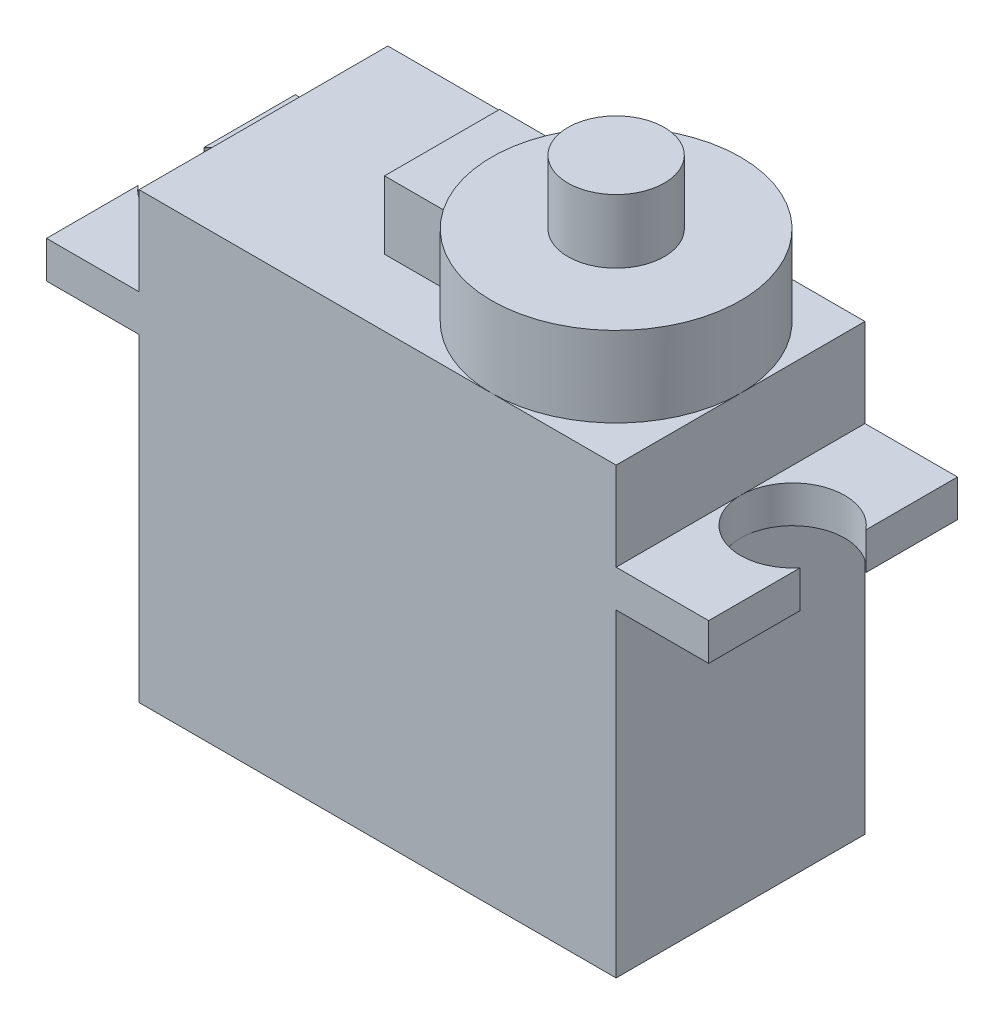
ISO-10303-21;
HEADER;
FILE_DESCRIPTION(('STEP AP214'),'2;1');
FILE_NAME('part.step','',(''),(''),'','','');
FILE_SCHEMA(('AUTOMOTIVE_DESIGN { 1 0 10303 214 1 1 1 1 }'));
ENDSEC;
DATA;
#1=APPLICATION_CONTEXT('core data for automotive mechanical design processes');
#2=APPLICATION_PROTOCOL_DEFINITION('international standard','automotive_design',2000,#1);
#3=PRODUCT_CONTEXT('',#1,'mechanical');
#4=PRODUCT('Part','Part','',(#3));
#5=PRODUCT_RELATED_PRODUCT_CATEGORY('part','',(#4));
#6=PRODUCT_DEFINITION_FORMATION('','',#4);
#7=PRODUCT_DEFINITION_CONTEXT('part definition',#1,'design');
#8=PRODUCT_DEFINITION('design','',#6,#7);
#9=PRODUCT_DEFINITION_SHAPE('','',#8);
#10=(LENGTH_UNIT() NAMED_UNIT(*) SI_UNIT(.MILLI.,.METRE.));
#11=(NAMED_UNIT(*) PLANE_ANGLE_UNIT() SI_UNIT($,.RADIAN.));
#12=(NAMED_UNIT(*) SI_UNIT($,.STERADIAN.) SOLID_ANGLE_UNIT());
#13=UNCERTAINTY_MEASURE_WITH_UNIT(LENGTH_MEASURE(1.E-05),#10,'distance_accuracy_value','');
#14=(GEOMETRIC_REPRESENTATION_CONTEXT(3) GLOBAL_UNCERTAINTY_ASSIGNED_CONTEXT((#13)) GLOBAL_UNIT_ASSIGNED_CONTEXT((#10,
#11,#12)) REPRESENTATION_CONTEXT('',''));
#15=CARTESIAN_POINT('',(0.,0.,0.));
#16=DIRECTION('',(0.,0.,1.));
#17=DIRECTION('',(1.,0.,0.));
#18=AXIS2_PLACEMENT_3D('',#15,#16,#17);
#19=CARTESIAN_POINT('',(0.,21.6,0.));
#20=DIRECTION('',(0.,1.,0.));
#21=DIRECTION('',(0.,0.,1.));
#22=AXIS2_PLACEMENT_3D('',#19,#20,#21);
#23=PLANE('',#22);
#24=DIRECTION('',(0.,0.,1.));
#25=VECTOR('',#24,1.);
#26=CARTESIAN_POINT('',(-2.91306815172061,21.6,-2.8));
#27=LINE('',#26,#25);
#28=CARTESIAN_POINT('',(-2.91306815172061,21.6,-2.8));
#29=VERTEX_POINT('',#28);
#30=CARTESIAN_POINT('',(-2.91306815172061,21.6,2.8));
#31=VERTEX_POINT('',#30);
#32=EDGE_CURVE('E243',#29,#31,#27,.T.);
#33=ORIENTED_EDGE('',*,*,#32,.F.);
#34=DIRECTION('',(-1.,0.,0.));
#35=VECTOR('',#34,1.);
#36=CARTESIAN_POINT('',(-2.91306815172061,21.6,-2.8));
#37=LINE('',#36,#35);
#38=CARTESIAN_POINT('',(0.186931848279386,21.6,-2.8));
#39=VERTEX_POINT('',#38);
#40=EDGE_CURVE('E231',#39,#29,#37,.T.);
#41=ORIENTED_EDGE('',*,*,#40,.F.);
#42=CARTESIAN_POINT('',(5.55,21.6,0.));
#43=DIRECTION('',(0.,1.,0.));
#44=DIRECTION('',(0.,0.,1.));
#45=AXIS2_PLACEMENT_3D('',#42,#43,#44);
#46=CIRCLE('',#45,6.05);
#47=CARTESIAN_POINT('',(5.55,21.6,-6.05));
#48=VERTEX_POINT('',#47);
#49=EDGE_CURVE('E83',#48,#39,#46,.T.);
#50=ORIENTED_EDGE('',*,*,#49,.F.);
#51=DIRECTION('',(-1.,0.,0.));
#52=VECTOR('',#51,1.);
#53=CARTESIAN_POINT('',(-11.6,21.6,-6.05));
#54=LINE('',#53,#52);
#55=CARTESIAN_POINT('',(-11.6,21.6,-6.05));
#56=VERTEX_POINT('',#55);
#57=EDGE_CURVE('E366',#48,#56,#54,.T.);
#58=ORIENTED_EDGE('',*,*,#57,.T.);
#59=DIRECTION('',(0.,0.,1.));
#60=VECTOR('',#59,1.);
#61=CARTESIAN_POINT('',(-11.6,21.6,-6.05));
#62=LINE('',#61,#60);
#63=CARTESIAN_POINT('',(-11.6,21.6,6.05));
#64=VERTEX_POINT('',#63);
#65=EDGE_CURVE('E371',#56,#64,#62,.T.);
#66=ORIENTED_EDGE('',*,*,#65,.T.);
#67=DIRECTION('',(1.,0.,0.));
#68=VECTOR('',#67,1.);
#69=CARTESIAN_POINT('',(-11.6,21.6,6.05));
#70=LINE('',#69,#68);
#71=CARTESIAN_POINT('',(5.55,21.6,6.05));
#72=VERTEX_POINT('',#71);
#73=EDGE_CURVE('E374',#64,#72,#70,.T.);
#74=ORIENTED_EDGE('',*,*,#73,.T.);
#75=CARTESIAN_POINT('',(0.186931848279386,21.6,2.8));
#76=VERTEX_POINT('',#75);
#77=EDGE_CURVE('E259',#76,#72,#46,.T.);
#78=ORIENTED_EDGE('',*,*,#77,.F.);
#79=DIRECTION('',(1.,0.,0.));
#80=VECTOR('',#79,1.);
#81=CARTESIAN_POINT('',(-2.91306815172061,21.6,2.8));
#82=LINE('',#81,#80);
#83=EDGE_CURVE('E226',#31,#76,#82,.T.);
#84=ORIENTED_EDGE('',*,*,#83,.F.);
#85=EDGE_LOOP('',(#33,#41,#50,#58,#66,#74,#78,#84));
#86=FACE_BOUND('',#85,.T.);
#87=ADVANCED_FACE('F60',(#86),#23,.T.);
#88=CARTESIAN_POINT('',(5.55,25.5,0.));
#89=DIRECTION('',(0.,-1.,0.));
#90=DIRECTION('',(0.,0.,-1.));
#91=AXIS2_PLACEMENT_3D('',#88,#89,#90);
#92=CYLINDRICAL_SURFACE('',#91,6.05);
#93=CARTESIAN_POINT('',(5.55,25.5,0.));
#94=DIRECTION('',(0.,1.,0.));
#95=DIRECTION('',(0.,0.,1.));
#96=AXIS2_PLACEMENT_3D('',#93,#94,#95);
#97=CIRCLE('',#96,6.05);
#98=CARTESIAN_POINT('',(5.55,25.5,6.05));
#99=VERTEX_POINT('',#98);
#100=EDGE_CURVE('E253',#99,#99,#97,.T.);
#101=ORIENTED_EDGE('',*,*,#100,.F.);
#102=EDGE_LOOP('',(#101));
#103=FACE_BOUND('',#102,.T.);
#104=DIRECTION('',(0.,-1.,0.));
#105=VECTOR('',#104,1.);
#106=CARTESIAN_POINT('',(0.186931848279386,25.5,-2.8));
#107=LINE('',#106,#105);
#108=CARTESIAN_POINT('',(0.186931848279386,24.9,-2.8));
#109=VERTEX_POINT('',#108);
#110=EDGE_CURVE('E12',#109,#39,#107,.T.);
#111=ORIENTED_EDGE('',*,*,#110,.F.);
#112=CARTESIAN_POINT('',(5.55,24.9,0.));
#113=DIRECTION('',(0.,1.,0.));
#114=DIRECTION('',(0.,0.,1.));
#115=AXIS2_PLACEMENT_3D('',#112,#113,#114);
#116=CIRCLE('',#115,6.05);
#117=CARTESIAN_POINT('',(0.186931848279386,24.9,2.8));
#118=VERTEX_POINT('',#117);
#119=EDGE_CURVE('E223',#109,#118,#116,.T.);
#120=ORIENTED_EDGE('',*,*,#119,.T.);
#121=DIRECTION('',(0.,-1.,0.));
#122=VECTOR('',#121,1.);
#123=CARTESIAN_POINT('',(0.186931848279386,25.5,2.8));
#124=LINE('',#123,#122);
#125=EDGE_CURVE('E68',#76,#118,#124,.F.);
#126=ORIENTED_EDGE('',*,*,#125,.F.);
#127=ORIENTED_EDGE('',*,*,#77,.T.);
#128=CARTESIAN_POINT('',(11.6,21.6,0.));
#129=VERTEX_POINT('',#128);
#130=EDGE_CURVE('E250',#72,#129,#46,.T.);
#131=ORIENTED_EDGE('',*,*,#130,.T.);
#132=EDGE_CURVE('E404',#129,#48,#46,.T.);
#133=ORIENTED_EDGE('',*,*,#132,.T.);
#134=ORIENTED_EDGE('',*,*,#49,.T.);
#135=EDGE_LOOP('',(#111,#120,#126,#127,#131,#133,#134));
#136=FACE_BOUND('',#135,.T.);
#137=ADVANCED_FACE('F411',(#103,#136),#92,.T.);
#138=CARTESIAN_POINT('',(5.55,25.5,0.));
#139=DIRECTION('',(0.,1.,0.));
#140=DIRECTION('',(0.,0.,1.));
#141=AXIS2_PLACEMENT_3D('',#138,#139,#140);
#142=PLANE('',#141);
#143=ORIENTED_EDGE('',*,*,#100,.T.);
#144=EDGE_LOOP('',(#143));
#145=FACE_BOUND('',#144,.T.);
#146=CARTESIAN_POINT('',(5.55,25.5,0.));
#147=DIRECTION('',(0.,1.,0.));
#148=DIRECTION('',(0.,0.,1.));
#149=AXIS2_PLACEMENT_3D('',#146,#147,#148);
#150=CIRCLE('',#149,2.345);
#151=CARTESIAN_POINT('',(5.55,25.5,2.345));
#152=VERTEX_POINT('',#151);
#153=EDGE_CURVE('E234',#152,#152,#150,.T.);
#154=ORIENTED_EDGE('',*,*,#153,.F.);
#155=EDGE_LOOP('',(#154));
#156=FACE_BOUND('',#155,.T.);
#157=ADVANCED_FACE('F504',(#145,#156),#142,.T.);
#158=ORIENTED_EDGE('',*,*,#130,.F.);
#159=CARTESIAN_POINT('',(11.6,21.6,6.05));
#160=VERTEX_POINT('',#159);
#161=EDGE_CURVE('E373',#72,#160,#70,.T.);
#162=ORIENTED_EDGE('',*,*,#161,.T.);
#163=DIRECTION('',(0.,0.,-1.));
#164=VECTOR('',#163,1.);
#165=CARTESIAN_POINT('',(11.6,21.6,-6.05));
#166=LINE('',#165,#164);
#167=EDGE_CURVE('E363',#160,#129,#166,.T.);
#168=ORIENTED_EDGE('',*,*,#167,.T.);
#169=EDGE_LOOP('',(#158,#162,#168));
#170=FACE_BOUND('',#169,.T.);
#171=ADVANCED_FACE('F427',(#170),#23,.T.);
#172=ORIENTED_EDGE('',*,*,#132,.F.);
#173=CARTESIAN_POINT('',(11.6,21.6,-6.05));
#174=VERTEX_POINT('',#173);
#175=EDGE_CURVE('E367',#129,#174,#166,.T.);
#176=ORIENTED_EDGE('',*,*,#175,.T.);
#177=EDGE_CURVE('E368',#174,#48,#54,.T.);
#178=ORIENTED_EDGE('',*,*,#177,.T.);
#179=EDGE_LOOP('',(#172,#176,#178));
#180=FACE_BOUND('',#179,.T.);
#181=ADVANCED_FACE('F418',(#180),#23,.T.);
#182=CARTESIAN_POINT('',(-11.6,21.6,-6.05));
#183=DIRECTION('',(1.,0.,0.));
#184=DIRECTION('',(0.,0.,-1.));
#185=AXIS2_PLACEMENT_3D('',#182,#183,#184);
#186=PLANE('',#185);
#187=DIRECTION('',(0.,0.,1.));
#188=VECTOR('',#187,1.);
#189=CARTESIAN_POINT('',(-11.6,17.3,0.));
#190=LINE('',#189,#188);
#191=CARTESIAN_POINT('',(-11.6,17.3,-6.05));
#192=VERTEX_POINT('',#191);
#193=CARTESIAN_POINT('',(-11.6,17.3,0.));
#194=VERTEX_POINT('',#193);
#195=EDGE_CURVE('E256',#192,#194,#190,.T.);
#196=ORIENTED_EDGE('',*,*,#195,.T.);
#197=DIRECTION('',(0.,0.,1.));
#198=VECTOR('',#197,1.);
#199=CARTESIAN_POINT('',(-11.6,17.3,0.));
#200=LINE('',#199,#198);
#201=CARTESIAN_POINT('',(-11.6,17.3,6.05));
#202=VERTEX_POINT('',#201);
#203=EDGE_CURVE('E291',#194,#202,#200,.T.);
#204=ORIENTED_EDGE('',*,*,#203,.T.);
#205=DIRECTION('',(0.,-1.,0.));
#206=VECTOR('',#205,1.);
#207=CARTESIAN_POINT('',(-11.6,21.6,6.05));
#208=LINE('',#207,#206);
#209=EDGE_CURVE('E393',#64,#202,#208,.T.);
#210=ORIENTED_EDGE('',*,*,#209,.F.);
#211=ORIENTED_EDGE('',*,*,#65,.F.);
#212=DIRECTION('',(0.,-1.,0.));
#213=VECTOR('',#212,1.);
#214=CARTESIAN_POINT('',(-11.6,21.6,-6.05));
#215=LINE('',#214,#213);
#216=EDGE_CURVE('E397',#56,#192,#215,.T.);
#217=ORIENTED_EDGE('',*,*,#216,.T.);
#218=EDGE_LOOP('',(#196,#204,#210,#211,#217));
#219=FACE_BOUND('',#218,.T.);
#220=ADVANCED_FACE('F453',(#219),#186,.F.);
#221=DIRECTION('',(0.,0.,1.));
#222=VECTOR('',#221,1.);
#223=CARTESIAN_POINT('',(-11.6,15.5,0.));
#224=LINE('',#223,#222);
#225=CARTESIAN_POINT('',(-11.6,15.5,0.));
#226=VERTEX_POINT('',#225);
#227=CARTESIAN_POINT('',(-11.6,15.5,6.05));
#228=VERTEX_POINT('',#227);
#229=EDGE_CURVE('E303',#226,#228,#224,.T.);
#230=ORIENTED_EDGE('',*,*,#229,.F.);
#231=DIRECTION('',(0.,0.,1.));
#232=VECTOR('',#231,1.);
#233=CARTESIAN_POINT('',(-11.6,15.5,0.));
#234=LINE('',#233,#232);
#235=CARTESIAN_POINT('',(-11.6,15.5,-6.05));
#236=VERTEX_POINT('',#235);
#237=EDGE_CURVE('E276',#236,#226,#234,.T.);
#238=ORIENTED_EDGE('',*,*,#237,.F.);
#239=CARTESIAN_POINT('',(-11.6,0.,-6.05));
#240=VERTEX_POINT('',#239);
#241=EDGE_CURVE('E396',#236,#240,#215,.T.);
#242=ORIENTED_EDGE('',*,*,#241,.T.);
#243=DIRECTION('',(0.,0.,1.));
#244=VECTOR('',#243,1.);
#245=CARTESIAN_POINT('',(-11.6,0.,-6.05));
#246=LINE('',#245,#244);
#247=CARTESIAN_POINT('',(-11.6,0.,6.05));
#248=VERTEX_POINT('',#247);
#249=EDGE_CURVE('E383',#240,#248,#246,.T.);
#250=ORIENTED_EDGE('',*,*,#249,.T.);
#251=EDGE_CURVE('E392',#228,#248,#208,.T.);
#252=ORIENTED_EDGE('',*,*,#251,.F.);
#253=EDGE_LOOP('',(#230,#238,#242,#250,#252));
#254=FACE_BOUND('',#253,.T.);
#255=ADVANCED_FACE('F473',(#254),#186,.F.);
#256=CARTESIAN_POINT('',(11.6,21.6,-6.05));
#257=DIRECTION('',(-1.,0.,0.));
#258=DIRECTION('',(0.,0.,1.));
#259=AXIS2_PLACEMENT_3D('',#256,#257,#258);
#260=PLANE('',#259);
#261=DIRECTION('',(0.,0.,1.));
#262=VECTOR('',#261,1.);
#263=CARTESIAN_POINT('',(11.6,17.3,0.));
#264=LINE('',#263,#262);
#265=CARTESIAN_POINT('',(11.6,17.3,0.));
#266=VERTEX_POINT('',#265);
#267=CARTESIAN_POINT('',(11.6,17.3,6.05));
#268=VERTEX_POINT('',#267);
#269=EDGE_CURVE('E330',#266,#268,#264,.T.);
#270=ORIENTED_EDGE('',*,*,#269,.F.);
#271=DIRECTION('',(0.,0.,1.));
#272=VECTOR('',#271,1.);
#273=CARTESIAN_POINT('',(11.6,17.3,0.));
#274=LINE('',#273,#272);
#275=CARTESIAN_POINT('',(11.6,17.3,-6.05));
#276=VERTEX_POINT('',#275);
#277=EDGE_CURVE('E338',#276,#266,#274,.T.);
#278=ORIENTED_EDGE('',*,*,#277,.F.);
#279=DIRECTION('',(0.,-1.,0.));
#280=VECTOR('',#279,1.);
#281=CARTESIAN_POINT('',(11.6,21.6,-6.05));
#282=LINE('',#281,#280);
#283=EDGE_CURVE('E401',#174,#276,#282,.T.);
#284=ORIENTED_EDGE('',*,*,#283,.F.);
#285=ORIENTED_EDGE('',*,*,#175,.F.);
#286=ORIENTED_EDGE('',*,*,#167,.F.);
#287=DIRECTION('',(0.,-1.,0.));
#288=VECTOR('',#287,1.);
#289=CARTESIAN_POINT('',(11.6,21.6,6.05));
#290=LINE('',#289,#288);
#291=EDGE_CURVE('E389',#160,#268,#290,.T.);
#292=ORIENTED_EDGE('',*,*,#291,.T.);
#293=EDGE_LOOP('',(#270,#278,#284,#285,#286,#292));
#294=FACE_BOUND('',#293,.T.);
#295=ADVANCED_FACE('F424',(#294),#260,.F.);
#296=DIRECTION('',(0.,0.,1.));
#297=VECTOR('',#296,1.);
#298=CARTESIAN_POINT('',(11.6,15.5,0.));
#299=LINE('',#298,#297);
#300=CARTESIAN_POINT('',(11.6,15.5,-6.05));
#301=VERTEX_POINT('',#300);
#302=CARTESIAN_POINT('',(11.6,15.5,0.));
#303=VERTEX_POINT('',#302);
#304=EDGE_CURVE('E351',#301,#303,#299,.T.);
#305=ORIENTED_EDGE('',*,*,#304,.T.);
#306=DIRECTION('',(0.,0.,1.));
#307=VECTOR('',#306,1.);
#308=CARTESIAN_POINT('',(11.6,15.5,0.));
#309=LINE('',#308,#307);
#310=CARTESIAN_POINT('',(11.6,15.5,6.05));
#311=VERTEX_POINT('',#310);
#312=EDGE_CURVE('E314',#303,#311,#309,.T.);
#313=ORIENTED_EDGE('',*,*,#312,.T.);
#314=CARTESIAN_POINT('',(11.6,0.,6.05));
#315=VERTEX_POINT('',#314);
#316=EDGE_CURVE('E377',#311,#315,#290,.T.);
#317=ORIENTED_EDGE('',*,*,#316,.T.);
#318=DIRECTION('',(0.,0.,-1.));
#319=VECTOR('',#318,1.);
#320=CARTESIAN_POINT('',(11.6,0.,-6.05));
#321=LINE('',#320,#319);
#322=CARTESIAN_POINT('',(11.6,0.,-6.05));
#323=VERTEX_POINT('',#322);
#324=EDGE_CURVE('E361',#315,#323,#321,.T.);
#325=ORIENTED_EDGE('',*,*,#324,.T.);
#326=EDGE_CURVE('E400',#301,#323,#282,.T.);
#327=ORIENTED_EDGE('',*,*,#326,.F.);
#328=EDGE_LOOP('',(#305,#313,#317,#325,#327));
#329=FACE_BOUND('',#328,.T.);
#330=ADVANCED_FACE('F62',(#329),#260,.F.);
#331=CARTESIAN_POINT('',(-11.6,21.6,-6.05));
#332=DIRECTION('',(0.,0.,1.));
#333=DIRECTION('',(1.,0.,0.));
#334=AXIS2_PLACEMENT_3D('',#331,#332,#333);
#335=PLANE('',#334);
#336=DIRECTION('',(-1.,0.,0.));
#337=VECTOR('',#336,1.);
#338=CARTESIAN_POINT('',(-11.6,0.,-6.05));
#339=LINE('',#338,#337);
#340=EDGE_CURVE('E380',#323,#240,#339,.T.);
#341=ORIENTED_EDGE('',*,*,#340,.T.);
#342=ORIENTED_EDGE('',*,*,#241,.F.);
#343=DIRECTION('',(-1.,0.,0.));
#344=VECTOR('',#343,1.);
#345=CARTESIAN_POINT('',(0.,15.5,-6.05));
#346=LINE('',#345,#344);
#347=CARTESIAN_POINT('',(-16.1,15.5,-6.04999999999999));
#348=VERTEX_POINT('',#347);
#349=EDGE_CURVE('E268',#236,#348,#346,.T.);
#350=ORIENTED_EDGE('',*,*,#349,.T.);
#351=DIRECTION('',(0.,-1.,0.));
#352=VECTOR('',#351,1.);
#353=CARTESIAN_POINT('',(-16.1,17.3,-6.04999999999999));
#354=LINE('',#353,#352);
#355=CARTESIAN_POINT('',(-16.1,17.3,-6.04999999999999));
#356=VERTEX_POINT('',#355);
#357=EDGE_CURVE('E264',#356,#348,#354,.T.);
#358=ORIENTED_EDGE('',*,*,#357,.F.);
#359=DIRECTION('',(-1.,0.,0.));
#360=VECTOR('',#359,1.);
#361=CARTESIAN_POINT('',(0.,17.3,-6.05));
#362=LINE('',#361,#360);
#363=EDGE_CURVE('E262',#192,#356,#362,.T.);
#364=ORIENTED_EDGE('',*,*,#363,.F.);
#365=ORIENTED_EDGE('',*,*,#216,.F.);
#366=ORIENTED_EDGE('',*,*,#57,.F.);
#367=ORIENTED_EDGE('',*,*,#177,.F.);
#368=ORIENTED_EDGE('',*,*,#283,.T.);
#369=DIRECTION('',(1.,0.,0.));
#370=VECTOR('',#369,1.);
#371=CARTESIAN_POINT('',(0.,17.3,-6.05));
#372=LINE('',#371,#370);
#373=CARTESIAN_POINT('',(16.1,17.3,-6.05));
#374=VERTEX_POINT('',#373);
#375=EDGE_CURVE('E342',#276,#374,#372,.T.);
#376=ORIENTED_EDGE('',*,*,#375,.T.);
#377=DIRECTION('',(0.,-1.,0.));
#378=VECTOR('',#377,1.);
#379=CARTESIAN_POINT('',(16.1,17.3,-6.05));
#380=LINE('',#379,#378);
#381=CARTESIAN_POINT('',(16.1,15.5,-6.05));
#382=VERTEX_POINT('',#381);
#383=EDGE_CURVE('E348',#374,#382,#380,.T.);
#384=ORIENTED_EDGE('',*,*,#383,.T.);
#385=DIRECTION('',(1.,0.,0.));
#386=VECTOR('',#385,1.);
#387=CARTESIAN_POINT('',(0.,15.5,-6.05));
#388=LINE('',#387,#386);
#389=EDGE_CURVE('E354',#301,#382,#388,.T.);
#390=ORIENTED_EDGE('',*,*,#389,.F.);
#391=ORIENTED_EDGE('',*,*,#326,.T.);
#392=EDGE_LOOP('',(#341,#342,#350,#358,#364,#365,#366,#367,#368,#376,#384,#390,#391));
#393=FACE_BOUND('',#392,.T.);
#394=ADVANCED_FACE('F448',(#393),#335,.F.);
#395=CARTESIAN_POINT('',(-11.6,21.6,6.05));
#396=DIRECTION('',(0.,0.,-1.));
#397=DIRECTION('',(-1.,0.,0.));
#398=AXIS2_PLACEMENT_3D('',#395,#396,#397);
#399=PLANE('',#398);
#400=DIRECTION('',(1.,0.,0.));
#401=VECTOR('',#400,1.);
#402=CARTESIAN_POINT('',(-11.6,0.,6.05));
#403=LINE('',#402,#401);
#404=EDGE_CURVE('E386',#248,#315,#403,.T.);
#405=ORIENTED_EDGE('',*,*,#404,.T.);
#406=ORIENTED_EDGE('',*,*,#316,.F.);
#407=DIRECTION('',(1.,0.,0.));
#408=VECTOR('',#407,1.);
#409=CARTESIAN_POINT('',(0.,15.5,6.05));
#410=LINE('',#409,#408);
#411=CARTESIAN_POINT('',(16.1,15.5,6.05));
#412=VERTEX_POINT('',#411);
#413=EDGE_CURVE('E321',#311,#412,#410,.T.);
#414=ORIENTED_EDGE('',*,*,#413,.T.);
#415=DIRECTION('',(0.,-1.,0.));
#416=VECTOR('',#415,1.);
#417=CARTESIAN_POINT('',(16.1,17.3,6.05));
#418=LINE('',#417,#416);
#419=CARTESIAN_POINT('',(16.1,17.3,6.05));
#420=VERTEX_POINT('',#419);
#421=EDGE_CURVE('E315',#420,#412,#418,.T.);
#422=ORIENTED_EDGE('',*,*,#421,.F.);
#423=DIRECTION('',(1.,0.,0.));
#424=VECTOR('',#423,1.);
#425=CARTESIAN_POINT('',(0.,17.3,6.05));
#426=LINE('',#425,#424);
#427=EDGE_CURVE('E328',#268,#420,#426,.T.);
#428=ORIENTED_EDGE('',*,*,#427,.F.);
#429=ORIENTED_EDGE('',*,*,#291,.F.);
#430=ORIENTED_EDGE('',*,*,#161,.F.);
#431=ORIENTED_EDGE('',*,*,#73,.F.);
#432=ORIENTED_EDGE('',*,*,#209,.T.);
#433=DIRECTION('',(-1.,0.,0.));
#434=VECTOR('',#433,1.);
#435=CARTESIAN_POINT('',(0.,17.3,6.05));
#436=LINE('',#435,#434);
#437=CARTESIAN_POINT('',(-16.1,17.3,6.05));
#438=VERTEX_POINT('',#437);
#439=EDGE_CURVE('E294',#202,#438,#436,.T.);
#440=ORIENTED_EDGE('',*,*,#439,.T.);
#441=DIRECTION('',(0.,-1.,0.));
#442=VECTOR('',#441,1.);
#443=CARTESIAN_POINT('',(-16.1,17.3,6.05));
#444=LINE('',#443,#442);
#445=CARTESIAN_POINT('',(-16.1,15.5,6.05));
#446=VERTEX_POINT('',#445);
#447=EDGE_CURVE('E308',#438,#446,#444,.T.);
#448=ORIENTED_EDGE('',*,*,#447,.T.);
#449=DIRECTION('',(-1.,0.,0.));
#450=VECTOR('',#449,1.);
#451=CARTESIAN_POINT('',(0.,15.5,6.05));
#452=LINE('',#451,#450);
#453=EDGE_CURVE('E288',#228,#446,#452,.T.);
#454=ORIENTED_EDGE('',*,*,#453,.F.);
#455=ORIENTED_EDGE('',*,*,#251,.T.);
#456=EDGE_LOOP('',(#405,#406,#414,#422,#428,#429,#430,#431,#432,#440,#448,#454,#455));
#457=FACE_BOUND('',#456,.T.);
#458=ADVANCED_FACE('F431',(#457),#399,.F.);
#459=CARTESIAN_POINT('',(0.,0.,0.));
#460=DIRECTION('',(0.,1.,0.));
#461=DIRECTION('',(0.,0.,1.));
#462=AXIS2_PLACEMENT_3D('',#459,#460,#461);
#463=PLANE('',#462);
#464=ORIENTED_EDGE('',*,*,#324,.F.);
#465=ORIENTED_EDGE('',*,*,#404,.F.);
#466=ORIENTED_EDGE('',*,*,#249,.F.);
#467=ORIENTED_EDGE('',*,*,#340,.F.);
#468=EDGE_LOOP('',(#464,#465,#466,#467));
#469=FACE_BOUND('',#468,.T.);
#470=ADVANCED_FACE('F478',(#469),#463,.F.);
#471=CARTESIAN_POINT('',(14.1344444444444,17.3,0.));
#472=DIRECTION('',(0.,-1.,0.));
#473=DIRECTION('',(0.,0.,-1.));
#474=AXIS2_PLACEMENT_3D('',#471,#472,#473);
#475=CYLINDRICAL_SURFACE('',#474,2.53444444444444);
#476=CARTESIAN_POINT('',(14.1344444444444,15.5,0.));
#477=DIRECTION('',(0.,-1.,0.));
#478=DIRECTION('',(0.,0.,-1.));
#479=AXIS2_PLACEMENT_3D('',#476,#477,#478);
#480=CIRCLE('',#479,2.53444444444444);
#481=CARTESIAN_POINT('',(16.1,15.5,-1.6));
#482=VERTEX_POINT('',#481);
#483=EDGE_CURVE('E327',#303,#482,#480,.T.);
#484=ORIENTED_EDGE('',*,*,#483,.T.);
#485=DIRECTION('',(0.,-1.,0.));
#486=VECTOR('',#485,1.);
#487=CARTESIAN_POINT('',(16.1,17.3,-1.6));
#488=LINE('',#487,#486);
#489=CARTESIAN_POINT('',(16.1,17.3,-1.6));
#490=VERTEX_POINT('',#489);
#491=EDGE_CURVE('E359',#490,#482,#488,.T.);
#492=ORIENTED_EDGE('',*,*,#491,.F.);
#493=CARTESIAN_POINT('',(14.1344444444444,17.3,0.));
#494=DIRECTION('',(0.,-1.,0.));
#495=DIRECTION('',(0.,0.,-1.));
#496=AXIS2_PLACEMENT_3D('',#493,#494,#495);
#497=CIRCLE('',#496,2.53444444444444);
#498=EDGE_CURVE('E336',#266,#490,#497,.T.);
#499=ORIENTED_EDGE('',*,*,#498,.F.);
#500=CARTESIAN_POINT('',(14.1344444444444,17.3,0.));
#501=DIRECTION('',(0.,-1.,0.));
#502=DIRECTION('',(0.,0.,-1.));
#503=AXIS2_PLACEMENT_3D('',#500,#501,#502);
#504=CIRCLE('',#503,2.53444444444444);
#505=CARTESIAN_POINT('',(16.1,17.3,1.6));
#506=VERTEX_POINT('',#505);
#507=EDGE_CURVE('E317',#506,#266,#504,.T.);
#508=ORIENTED_EDGE('',*,*,#507,.F.);
#509=DIRECTION('',(0.,-1.,0.));
#510=VECTOR('',#509,1.);
#511=CARTESIAN_POINT('',(16.1,17.3,1.6));
#512=LINE('',#511,#510);
#513=CARTESIAN_POINT('',(16.1,15.5,1.6));
#514=VERTEX_POINT('',#513);
#515=EDGE_CURVE('E312',#506,#514,#512,.T.);
#516=ORIENTED_EDGE('',*,*,#515,.T.);
#517=CARTESIAN_POINT('',(14.1344444444444,15.5,0.));
#518=DIRECTION('',(0.,-1.,0.));
#519=DIRECTION('',(0.,0.,-1.));
#520=AXIS2_PLACEMENT_3D('',#517,#518,#519);
#521=CIRCLE('',#520,2.53444444444444);
#522=EDGE_CURVE('E310',#514,#303,#521,.T.);
#523=ORIENTED_EDGE('',*,*,#522,.T.);
#524=EDGE_LOOP('',(#484,#492,#499,#508,#516,#523));
#525=FACE_BOUND('',#524,.T.);
#526=ADVANCED_FACE('F441',(#525),#475,.F.);
#527=CARTESIAN_POINT('',(16.1,17.3,0.));
#528=DIRECTION('',(1.,0.,0.));
#529=DIRECTION('',(0.,0.,-1.));
#530=AXIS2_PLACEMENT_3D('',#527,#528,#529);
#531=PLANE('',#530);
#532=DIRECTION('',(0.,0.,1.));
#533=VECTOR('',#532,1.);
#534=CARTESIAN_POINT('',(16.1,15.5,0.));
#535=LINE('',#534,#533);
#536=EDGE_CURVE('E339',#382,#482,#535,.T.);
#537=ORIENTED_EDGE('',*,*,#536,.F.);
#538=ORIENTED_EDGE('',*,*,#383,.F.);
#539=DIRECTION('',(0.,0.,1.));
#540=VECTOR('',#539,1.);
#541=CARTESIAN_POINT('',(16.1,17.3,0.));
#542=LINE('',#541,#540);
#543=EDGE_CURVE('E345',#374,#490,#542,.T.);
#544=ORIENTED_EDGE('',*,*,#543,.T.);
#545=ORIENTED_EDGE('',*,*,#491,.T.);
#546=EDGE_LOOP('',(#537,#538,#544,#545));
#547=FACE_BOUND('',#546,.T.);
#548=ADVANCED_FACE('F446',(#547),#531,.T.);
#549=CARTESIAN_POINT('',(0.,17.3,0.));
#550=DIRECTION('',(0.,-1.,0.));
#551=DIRECTION('',(0.,0.,-1.));
#552=AXIS2_PLACEMENT_3D('',#549,#550,#551);
#553=PLANE('',#552);
#554=ORIENTED_EDGE('',*,*,#498,.T.);
#555=ORIENTED_EDGE('',*,*,#543,.F.);
#556=ORIENTED_EDGE('',*,*,#375,.F.);
#557=ORIENTED_EDGE('',*,*,#277,.T.);
#558=EDGE_LOOP('',(#554,#555,#556,#557));
#559=FACE_BOUND('',#558,.T.);
#560=ADVANCED_FACE('F436',(#559),#553,.F.);
#561=CARTESIAN_POINT('',(0.,15.5,0.));
#562=DIRECTION('',(0.,-1.,0.));
#563=DIRECTION('',(0.,0.,-1.));
#564=AXIS2_PLACEMENT_3D('',#561,#562,#563);
#565=PLANE('',#564);
#566=ORIENTED_EDGE('',*,*,#483,.F.);
#567=ORIENTED_EDGE('',*,*,#304,.F.);
#568=ORIENTED_EDGE('',*,*,#389,.T.);
#569=ORIENTED_EDGE('',*,*,#536,.T.);
#570=EDGE_LOOP('',(#566,#567,#568,#569));
#571=FACE_BOUND('',#570,.T.);
#572=ADVANCED_FACE('F496',(#571),#565,.T.);
#573=CARTESIAN_POINT('',(16.1,17.3,0.));
#574=DIRECTION('',(1.,0.,0.));
#575=DIRECTION('',(0.,0.,-1.));
#576=AXIS2_PLACEMENT_3D('',#573,#574,#575);
#577=PLANE('',#576);
#578=DIRECTION('',(0.,0.,1.));
#579=VECTOR('',#578,1.);
#580=CARTESIAN_POINT('',(16.1,15.5,0.));
#581=LINE('',#580,#579);
#582=EDGE_CURVE('E324',#514,#412,#581,.T.);
#583=ORIENTED_EDGE('',*,*,#582,.F.);
#584=ORIENTED_EDGE('',*,*,#515,.F.);
#585=DIRECTION('',(0.,0.,1.));
#586=VECTOR('',#585,1.);
#587=CARTESIAN_POINT('',(16.1,17.3,0.));
#588=LINE('',#587,#586);
#589=EDGE_CURVE('E318',#506,#420,#588,.T.);
#590=ORIENTED_EDGE('',*,*,#589,.T.);
#591=ORIENTED_EDGE('',*,*,#421,.T.);
#592=EDGE_LOOP('',(#583,#584,#590,#591));
#593=FACE_BOUND('',#592,.T.);
#594=ADVANCED_FACE('F487',(#593),#577,.T.);
#595=CARTESIAN_POINT('',(0.,17.3,0.));
#596=DIRECTION('',(0.,-1.,0.));
#597=DIRECTION('',(0.,0.,-1.));
#598=AXIS2_PLACEMENT_3D('',#595,#596,#597);
#599=PLANE('',#598);
#600=ORIENTED_EDGE('',*,*,#507,.T.);
#601=ORIENTED_EDGE('',*,*,#269,.T.);
#602=ORIENTED_EDGE('',*,*,#427,.T.);
#603=ORIENTED_EDGE('',*,*,#589,.F.);
#604=EDGE_LOOP('',(#600,#601,#602,#603));
#605=FACE_BOUND('',#604,.T.);
#606=ADVANCED_FACE('F488',(#605),#599,.F.);
#607=CARTESIAN_POINT('',(0.,15.5,0.));
#608=DIRECTION('',(0.,-1.,0.));
#609=DIRECTION('',(0.,0.,-1.));
#610=AXIS2_PLACEMENT_3D('',#607,#608,#609);
#611=PLANE('',#610);
#612=ORIENTED_EDGE('',*,*,#522,.F.);
#613=ORIENTED_EDGE('',*,*,#582,.T.);
#614=ORIENTED_EDGE('',*,*,#413,.F.);
#615=ORIENTED_EDGE('',*,*,#312,.F.);
#616=EDGE_LOOP('',(#612,#613,#614,#615));
#617=FACE_BOUND('',#616,.T.);
#618=ADVANCED_FACE('F485',(#617),#611,.T.);
#619=CARTESIAN_POINT('',(-16.1,17.3,0.));
#620=DIRECTION('',(1.,0.,0.));
#621=DIRECTION('',(0.,0.,-1.));
#622=AXIS2_PLACEMENT_3D('',#619,#620,#621);
#623=PLANE('',#622);
#624=DIRECTION('',(0.,0.,1.));
#625=VECTOR('',#624,1.);
#626=CARTESIAN_POINT('',(-16.1,15.5,0.));
#627=LINE('',#626,#625);
#628=CARTESIAN_POINT('',(-16.1,15.5,1.60000000000001));
#629=VERTEX_POINT('',#628);
#630=EDGE_CURVE('E275',#629,#446,#627,.T.);
#631=ORIENTED_EDGE('',*,*,#630,.T.);
#632=ORIENTED_EDGE('',*,*,#447,.F.);
#633=DIRECTION('',(0.,0.,1.));
#634=VECTOR('',#633,1.);
#635=CARTESIAN_POINT('',(-16.1,17.3,0.));
#636=LINE('',#635,#634);
#637=CARTESIAN_POINT('',(-16.1,17.3,1.60000000000001));
#638=VERTEX_POINT('',#637);
#639=EDGE_CURVE('E285',#638,#438,#636,.T.);
#640=ORIENTED_EDGE('',*,*,#639,.F.);
#641=DIRECTION('',(0.,-1.,0.));
#642=VECTOR('',#641,1.);
#643=CARTESIAN_POINT('',(-16.1,17.3,1.60000000000001));
#644=LINE('',#643,#642);
#645=EDGE_CURVE('E297',#638,#629,#644,.T.);
#646=ORIENTED_EDGE('',*,*,#645,.T.);
#647=EDGE_LOOP('',(#631,#632,#640,#646));
#648=FACE_BOUND('',#647,.T.);
#649=ADVANCED_FACE('F461',(#648),#623,.F.);
#650=CARTESIAN_POINT('',(-14.1344444444444,17.3,0.));
#651=DIRECTION('',(0.,-1.,0.));
#652=DIRECTION('',(0.,0.,-1.));
#653=AXIS2_PLACEMENT_3D('',#650,#651,#652);
#654=CYLINDRICAL_SURFACE('',#653,2.53444444444444);
#655=CARTESIAN_POINT('',(-14.1344444444444,15.5,0.));
#656=DIRECTION('',(0.,-1.,0.));
#657=DIRECTION('',(0.,0.,-1.));
#658=AXIS2_PLACEMENT_3D('',#655,#656,#657);
#659=CIRCLE('',#658,2.53444444444444);
#660=EDGE_CURVE('E300',#629,#226,#659,.F.);
#661=ORIENTED_EDGE('',*,*,#660,.F.);
#662=ORIENTED_EDGE('',*,*,#645,.F.);
#663=CARTESIAN_POINT('',(-14.1344444444444,17.3,0.));
#664=DIRECTION('',(0.,-1.,0.));
#665=DIRECTION('',(0.,0.,-1.));
#666=AXIS2_PLACEMENT_3D('',#663,#664,#665);
#667=CIRCLE('',#666,2.53444444444444);
#668=EDGE_CURVE('E287',#638,#194,#667,.F.);
#669=ORIENTED_EDGE('',*,*,#668,.T.);
#670=CARTESIAN_POINT('',(-14.1344444444444,17.3,0.));
#671=DIRECTION('',(0.,-1.,0.));
#672=DIRECTION('',(0.,0.,-1.));
#673=AXIS2_PLACEMENT_3D('',#670,#671,#672);
#674=CIRCLE('',#673,2.53444444444444);
#675=CARTESIAN_POINT('',(-16.1,17.3,-1.59999999999999));
#676=VERTEX_POINT('',#675);
#677=EDGE_CURVE('E263',#194,#676,#674,.F.);
#678=ORIENTED_EDGE('',*,*,#677,.T.);
#679=DIRECTION('',(0.,-1.,0.));
#680=VECTOR('',#679,1.);
#681=CARTESIAN_POINT('',(-16.1,17.3,-1.59999999999999));
#682=LINE('',#681,#680);
#683=CARTESIAN_POINT('',(-16.1,15.5,-1.59999999999999));
#684=VERTEX_POINT('',#683);
#685=EDGE_CURVE('E260',#676,#684,#682,.T.);
#686=ORIENTED_EDGE('',*,*,#685,.T.);
#687=CARTESIAN_POINT('',(-14.1344444444444,15.5,0.));
#688=DIRECTION('',(0.,-1.,0.));
#689=DIRECTION('',(0.,0.,-1.));
#690=AXIS2_PLACEMENT_3D('',#687,#688,#689);
#691=CIRCLE('',#690,2.53444444444444);
#692=EDGE_CURVE('E272',#226,#684,#691,.F.);
#693=ORIENTED_EDGE('',*,*,#692,.F.);
#694=EDGE_LOOP('',(#661,#662,#669,#678,#686,#693));
#695=FACE_BOUND('',#694,.T.);
#696=ADVANCED_FACE('F599',(#695),#654,.F.);
#697=CARTESIAN_POINT('',(0.,17.3,0.));
#698=DIRECTION('',(0.,-1.,0.));
#699=DIRECTION('',(0.,0.,-1.));
#700=AXIS2_PLACEMENT_3D('',#697,#698,#699);
#701=PLANE('',#700);
#702=ORIENTED_EDGE('',*,*,#639,.T.);
#703=ORIENTED_EDGE('',*,*,#439,.F.);
#704=ORIENTED_EDGE('',*,*,#203,.F.);
#705=ORIENTED_EDGE('',*,*,#668,.F.);
#706=EDGE_LOOP('',(#702,#703,#704,#705));
#707=FACE_BOUND('',#706,.T.);
#708=ADVANCED_FACE('F457',(#707),#701,.F.);
#709=CARTESIAN_POINT('',(0.,15.5,0.));
#710=DIRECTION('',(0.,-1.,0.));
#711=DIRECTION('',(0.,0.,-1.));
#712=AXIS2_PLACEMENT_3D('',#709,#710,#711);
#713=PLANE('',#712);
#714=ORIENTED_EDGE('',*,*,#630,.F.);
#715=ORIENTED_EDGE('',*,*,#660,.T.);
#716=ORIENTED_EDGE('',*,*,#229,.T.);
#717=ORIENTED_EDGE('',*,*,#453,.T.);
#718=EDGE_LOOP('',(#714,#715,#716,#717));
#719=FACE_BOUND('',#718,.T.);
#720=ADVANCED_FACE('F465',(#719),#713,.T.);
#721=CARTESIAN_POINT('',(-16.1,17.3,0.));
#722=DIRECTION('',(1.,0.,0.));
#723=DIRECTION('',(0.,0.,-1.));
#724=AXIS2_PLACEMENT_3D('',#721,#722,#723);
#725=PLANE('',#724);
#726=DIRECTION('',(0.,0.,1.));
#727=VECTOR('',#726,1.);
#728=CARTESIAN_POINT('',(-16.1,15.5,0.));
#729=LINE('',#728,#727);
#730=EDGE_CURVE('E267',#348,#684,#729,.T.);
#731=ORIENTED_EDGE('',*,*,#730,.T.);
#732=ORIENTED_EDGE('',*,*,#685,.F.);
#733=DIRECTION('',(0.,0.,1.));
#734=VECTOR('',#733,1.);
#735=CARTESIAN_POINT('',(-16.1,17.3,0.));
#736=LINE('',#735,#734);
#737=EDGE_CURVE('E278',#356,#676,#736,.T.);
#738=ORIENTED_EDGE('',*,*,#737,.F.);
#739=ORIENTED_EDGE('',*,*,#357,.T.);
#740=EDGE_LOOP('',(#731,#732,#738,#739));
#741=FACE_BOUND('',#740,.T.);
#742=ADVANCED_FACE('F626',(#741),#725,.F.);
#743=CARTESIAN_POINT('',(0.,17.3,0.));
#744=DIRECTION('',(0.,-1.,0.));
#745=DIRECTION('',(0.,0.,-1.));
#746=AXIS2_PLACEMENT_3D('',#743,#744,#745);
#747=PLANE('',#746);
#748=ORIENTED_EDGE('',*,*,#195,.F.);
#749=ORIENTED_EDGE('',*,*,#363,.T.);
#750=ORIENTED_EDGE('',*,*,#737,.T.);
#751=ORIENTED_EDGE('',*,*,#677,.F.);
#752=EDGE_LOOP('',(#748,#749,#750,#751));
#753=FACE_BOUND('',#752,.T.);
#754=ADVANCED_FACE('F635',(#753),#747,.F.);
#755=CARTESIAN_POINT('',(0.,15.5,0.));
#756=DIRECTION('',(0.,-1.,0.));
#757=DIRECTION('',(0.,0.,-1.));
#758=AXIS2_PLACEMENT_3D('',#755,#756,#757);
#759=PLANE('',#758);
#760=ORIENTED_EDGE('',*,*,#237,.T.);
#761=ORIENTED_EDGE('',*,*,#692,.T.);
#762=ORIENTED_EDGE('',*,*,#730,.F.);
#763=ORIENTED_EDGE('',*,*,#349,.F.);
#764=EDGE_LOOP('',(#760,#761,#762,#763));
#765=FACE_BOUND('',#764,.T.);
#766=ADVANCED_FACE('F645',(#765),#759,.T.);
#767=CARTESIAN_POINT('',(5.55,28.6,0.));
#768=DIRECTION('',(0.,-1.,0.));
#769=DIRECTION('',(0.,0.,-1.));
#770=AXIS2_PLACEMENT_3D('',#767,#768,#769);
#771=CYLINDRICAL_SURFACE('',#770,2.345);
#772=CARTESIAN_POINT('',(5.55,28.6,0.));
#773=DIRECTION('',(0.,1.,0.));
#774=DIRECTION('',(0.,0.,1.));
#775=AXIS2_PLACEMENT_3D('',#772,#773,#774);
#776=CIRCLE('',#775,2.345);
#777=CARTESIAN_POINT('',(5.55,28.6,2.345));
#778=VERTEX_POINT('',#777);
#779=EDGE_CURVE('E247',#778,#778,#776,.T.);
#780=ORIENTED_EDGE('',*,*,#779,.F.);
#781=EDGE_LOOP('',(#780));
#782=FACE_BOUND('',#781,.T.);
#783=ORIENTED_EDGE('',*,*,#153,.T.);
#784=EDGE_LOOP('',(#783));
#785=FACE_BOUND('',#784,.T.);
#786=ADVANCED_FACE('F655',(#782,#785),#771,.T.);
#787=CARTESIAN_POINT('',(5.55,28.6,0.));
#788=DIRECTION('',(0.,1.,0.));
#789=DIRECTION('',(0.,0.,1.));
#790=AXIS2_PLACEMENT_3D('',#787,#788,#789);
#791=PLANE('',#790);
#792=ORIENTED_EDGE('',*,*,#779,.T.);
#793=EDGE_LOOP('',(#792));
#794=FACE_BOUND('',#793,.T.);
#795=ADVANCED_FACE('F695',(#794),#791,.T.);
#796=CARTESIAN_POINT('',(-2.91306815172061,24.9,-2.8));
#797=DIRECTION('',(0.,0.,1.));
#798=DIRECTION('',(1.,0.,0.));
#799=AXIS2_PLACEMENT_3D('',#796,#797,#798);
#800=PLANE('',#799);
#801=DIRECTION('',(-1.,0.,0.));
#802=VECTOR('',#801,1.);
#803=CARTESIAN_POINT('',(-2.91306815172061,24.9,-2.8));
#804=LINE('',#803,#802);
#805=CARTESIAN_POINT('',(-2.91306815172061,24.9,-2.8));
#806=VERTEX_POINT('',#805);
#807=EDGE_CURVE('E216',#109,#806,#804,.T.);
#808=ORIENTED_EDGE('',*,*,#807,.F.);
#809=ORIENTED_EDGE('',*,*,#110,.T.);
#810=ORIENTED_EDGE('',*,*,#40,.T.);
#811=DIRECTION('',(0.,-1.,0.));
#812=VECTOR('',#811,1.);
#813=CARTESIAN_POINT('',(-2.91306815172061,24.9,-2.8));
#814=LINE('',#813,#812);
#815=EDGE_CURVE('E229',#806,#29,#814,.T.);
#816=ORIENTED_EDGE('',*,*,#815,.F.);
#817=EDGE_LOOP('',(#808,#809,#810,#816));
#818=FACE_BOUND('',#817,.T.);
#819=ADVANCED_FACE('F230',(#818),#800,.F.);
#820=CARTESIAN_POINT('',(-2.91306815172061,24.9,2.8));
#821=DIRECTION('',(0.,0.,-1.));
#822=DIRECTION('',(-1.,0.,0.));
#823=AXIS2_PLACEMENT_3D('',#820,#821,#822);
#824=PLANE('',#823);
#825=ORIENTED_EDGE('',*,*,#83,.T.);
#826=ORIENTED_EDGE('',*,*,#125,.T.);
#827=DIRECTION('',(1.,0.,0.));
#828=VECTOR('',#827,1.);
#829=CARTESIAN_POINT('',(-2.91306815172061,24.9,2.8));
#830=LINE('',#829,#828);
#831=CARTESIAN_POINT('',(-2.91306815172061,24.9,2.8));
#832=VERTEX_POINT('',#831);
#833=EDGE_CURVE('E75',#832,#118,#830,.T.);
#834=ORIENTED_EDGE('',*,*,#833,.F.);
#835=DIRECTION('',(0.,-1.,0.));
#836=VECTOR('',#835,1.);
#837=CARTESIAN_POINT('',(-2.91306815172061,24.9,2.8));
#838=LINE('',#837,#836);
#839=EDGE_CURVE('E235',#832,#31,#838,.T.);
#840=ORIENTED_EDGE('',*,*,#839,.T.);
#841=EDGE_LOOP('',(#825,#826,#834,#840));
#842=FACE_BOUND('',#841,.T.);
#843=ADVANCED_FACE('F407',(#842),#824,.F.);
#844=CARTESIAN_POINT('',(0.,24.9,0.));
#845=DIRECTION('',(0.,1.,0.));
#846=DIRECTION('',(0.,0.,1.));
#847=AXIS2_PLACEMENT_3D('',#844,#845,#846);
#848=PLANE('',#847);
#849=ORIENTED_EDGE('',*,*,#119,.F.);
#850=ORIENTED_EDGE('',*,*,#807,.T.);
#851=DIRECTION('',(0.,0.,1.));
#852=VECTOR('',#851,1.);
#853=CARTESIAN_POINT('',(-2.91306815172061,24.9,-2.8));
#854=LINE('',#853,#852);
#855=EDGE_CURVE('E220',#806,#832,#854,.T.);
#856=ORIENTED_EDGE('',*,*,#855,.T.);
#857=ORIENTED_EDGE('',*,*,#833,.T.);
#858=EDGE_LOOP('',(#849,#850,#856,#857));
#859=FACE_BOUND('',#858,.T.);
#860=ADVANCED_FACE('F218',(#859),#848,.T.);
#861=CARTESIAN_POINT('',(-2.91306815172061,24.9,-2.8));
#862=DIRECTION('',(1.,0.,0.));
#863=DIRECTION('',(0.,0.,-1.));
#864=AXIS2_PLACEMENT_3D('',#861,#862,#863);
#865=PLANE('',#864);
#866=ORIENTED_EDGE('',*,*,#32,.T.);
#867=ORIENTED_EDGE('',*,*,#839,.F.);
#868=ORIENTED_EDGE('',*,*,#855,.F.);
#869=ORIENTED_EDGE('',*,*,#815,.T.);
#870=EDGE_LOOP('',(#866,#867,#868,#869));
#871=FACE_BOUND('',#870,.T.);
#872=ADVANCED_FACE('F237',(#871),#865,.F.);
#873=CLOSED_SHELL('',(#87,#137,#157,#171,#181,#220,#255,#295,#330,#394,#458,#470,#526,#548,#560,
#572,#594,#606,#618,#649,#696,#708,#720,#742,#754,#766,#786,#795,#819,#843,#860,#872));
#874=MANIFOLD_SOLID_BREP('B2',#873);
#875=ADVANCED_BREP_SHAPE_REPRESENTATION('',(#18,#874),#14);
#876=SHAPE_DEFINITION_REPRESENTATION(#9,#875);
ENDSEC;
END-ISO-10303-21;
